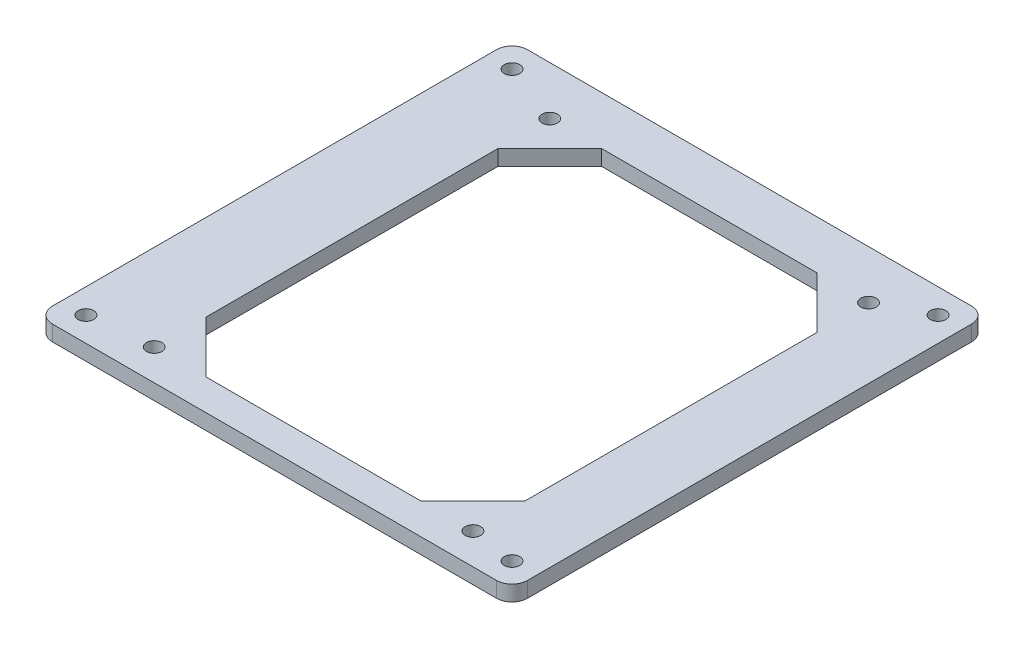
ISO-10303-21;
HEADER;
FILE_DESCRIPTION(('STEP AP214'),'2;1');
FILE_NAME('part.step','',(''),(''),'','','');
FILE_SCHEMA(('AUTOMOTIVE_DESIGN { 1 0 10303 214 1 1 1 1 }'));
ENDSEC;
DATA;
#1=APPLICATION_CONTEXT('core data for automotive mechanical design processes');
#2=APPLICATION_PROTOCOL_DEFINITION('international standard','automotive_design',2000,#1);
#3=PRODUCT_CONTEXT('',#1,'mechanical');
#4=PRODUCT('Part','Part','',(#3));
#5=PRODUCT_RELATED_PRODUCT_CATEGORY('part','',(#4));
#6=PRODUCT_DEFINITION_FORMATION('','',#4);
#7=PRODUCT_DEFINITION_CONTEXT('part definition',#1,'design');
#8=PRODUCT_DEFINITION('design','',#6,#7);
#9=PRODUCT_DEFINITION_SHAPE('','',#8);
#10=(LENGTH_UNIT() NAMED_UNIT(*) SI_UNIT(.MILLI.,.METRE.));
#11=(NAMED_UNIT(*) PLANE_ANGLE_UNIT() SI_UNIT($,.RADIAN.));
#12=(NAMED_UNIT(*) SI_UNIT($,.STERADIAN.) SOLID_ANGLE_UNIT());
#13=UNCERTAINTY_MEASURE_WITH_UNIT(LENGTH_MEASURE(1.E-05),#10,'distance_accuracy_value','');
#14=(GEOMETRIC_REPRESENTATION_CONTEXT(3) GLOBAL_UNCERTAINTY_ASSIGNED_CONTEXT((#13)) GLOBAL_UNIT_ASSIGNED_CONTEXT((#10,
#11,#12)) REPRESENTATION_CONTEXT('',''));
#15=CARTESIAN_POINT('',(0.,0.,0.));
#16=DIRECTION('',(0.,0.,1.));
#17=DIRECTION('',(1.,0.,0.));
#18=AXIS2_PLACEMENT_3D('',#15,#16,#17);
#19=CARTESIAN_POINT('',(-43.,0.,-43.));
#20=DIRECTION('',(0.,1.,0.));
#21=DIRECTION('',(0.,0.,1.));
#22=AXIS2_PLACEMENT_3D('',#19,#20,#21);
#23=CYLINDRICAL_SURFACE('',#22,3.);
#24=CARTESIAN_POINT('',(-43.,3.,-43.));
#25=DIRECTION('',(0.,1.,0.));
#26=DIRECTION('',(0.,0.,1.));
#27=AXIS2_PLACEMENT_3D('',#24,#25,#26);
#28=CIRCLE('',#27,3.);
#29=CARTESIAN_POINT('',(-43.,3.,-46.));
#30=VERTEX_POINT('',#29);
#31=CARTESIAN_POINT('',(-46.,3.,-43.));
#32=VERTEX_POINT('',#31);
#33=EDGE_CURVE('E211',#30,#32,#28,.T.);
#34=ORIENTED_EDGE('',*,*,#33,.F.);
#35=DIRECTION('',(0.,1.,0.));
#36=VECTOR('',#35,1.);
#37=CARTESIAN_POINT('',(-43.,0.,-46.));
#38=LINE('',#37,#36);
#39=CARTESIAN_POINT('',(-43.,0.,-46.));
#40=VERTEX_POINT('',#39);
#41=EDGE_CURVE('E11',#40,#30,#38,.T.);
#42=ORIENTED_EDGE('',*,*,#41,.F.);
#43=CARTESIAN_POINT('',(-43.,0.,-43.));
#44=DIRECTION('',(0.,1.,0.));
#45=DIRECTION('',(0.,0.,1.));
#46=AXIS2_PLACEMENT_3D('',#43,#44,#45);
#47=CIRCLE('',#46,3.);
#48=CARTESIAN_POINT('',(-46.,0.,-43.));
#49=VERTEX_POINT('',#48);
#50=EDGE_CURVE('E223',#40,#49,#47,.T.);
#51=ORIENTED_EDGE('',*,*,#50,.T.);
#52=DIRECTION('',(0.,1.,0.));
#53=VECTOR('',#52,1.);
#54=CARTESIAN_POINT('',(-46.,0.,-43.));
#55=LINE('',#54,#53);
#56=EDGE_CURVE('E40',#49,#32,#55,.T.);
#57=ORIENTED_EDGE('',*,*,#56,.T.);
#58=EDGE_LOOP('',(#34,#42,#51,#57));
#59=FACE_BOUND('',#58,.T.);
#60=ADVANCED_FACE('F37',(#59),#23,.T.);
#61=CARTESIAN_POINT('',(43.,0.,-46.));
#62=DIRECTION('',(0.,0.,-1.));
#63=DIRECTION('',(-1.,0.,0.));
#64=AXIS2_PLACEMENT_3D('',#61,#62,#63);
#65=PLANE('',#64);
#66=DIRECTION('',(-1.,0.,0.));
#67=VECTOR('',#66,1.);
#68=CARTESIAN_POINT('',(43.,3.,-46.));
#69=LINE('',#68,#67);
#70=CARTESIAN_POINT('',(43.,3.,-46.));
#71=VERTEX_POINT('',#70);
#72=EDGE_CURVE('E227',#71,#30,#69,.T.);
#73=ORIENTED_EDGE('',*,*,#72,.F.);
#74=DIRECTION('',(0.,1.,0.));
#75=VECTOR('',#74,1.);
#76=CARTESIAN_POINT('',(43.,0.,-46.));
#77=LINE('',#76,#75);
#78=CARTESIAN_POINT('',(43.,0.,-46.));
#79=VERTEX_POINT('',#78);
#80=EDGE_CURVE('E45',#79,#71,#77,.T.);
#81=ORIENTED_EDGE('',*,*,#80,.F.);
#82=DIRECTION('',(-1.,0.,0.));
#83=VECTOR('',#82,1.);
#84=CARTESIAN_POINT('',(43.,0.,-46.));
#85=LINE('',#84,#83);
#86=EDGE_CURVE('E245',#79,#40,#85,.T.);
#87=ORIENTED_EDGE('',*,*,#86,.T.);
#88=ORIENTED_EDGE('',*,*,#41,.T.);
#89=EDGE_LOOP('',(#73,#81,#87,#88));
#90=FACE_BOUND('',#89,.T.);
#91=ADVANCED_FACE('F292',(#90),#65,.T.);
#92=CARTESIAN_POINT('',(43.,0.,-43.));
#93=DIRECTION('',(0.,1.,0.));
#94=DIRECTION('',(0.,0.,1.));
#95=AXIS2_PLACEMENT_3D('',#92,#93,#94);
#96=CYLINDRICAL_SURFACE('',#95,3.);
#97=CARTESIAN_POINT('',(43.,3.,-43.));
#98=DIRECTION('',(0.,1.,0.));
#99=DIRECTION('',(0.,0.,1.));
#100=AXIS2_PLACEMENT_3D('',#97,#98,#99);
#101=CIRCLE('',#100,3.);
#102=CARTESIAN_POINT('',(46.,3.,-43.));
#103=VERTEX_POINT('',#102);
#104=EDGE_CURVE('E265',#103,#71,#101,.T.);
#105=ORIENTED_EDGE('',*,*,#104,.F.);
#106=DIRECTION('',(0.,1.,0.));
#107=VECTOR('',#106,1.);
#108=CARTESIAN_POINT('',(46.,0.,-43.));
#109=LINE('',#108,#107);
#110=CARTESIAN_POINT('',(46.,0.,-43.));
#111=VERTEX_POINT('',#110);
#112=EDGE_CURVE('E271',#111,#103,#109,.T.);
#113=ORIENTED_EDGE('',*,*,#112,.F.);
#114=CARTESIAN_POINT('',(43.,0.,-43.));
#115=DIRECTION('',(0.,1.,0.));
#116=DIRECTION('',(0.,0.,1.));
#117=AXIS2_PLACEMENT_3D('',#114,#115,#116);
#118=CIRCLE('',#117,3.);
#119=EDGE_CURVE('E242',#111,#79,#118,.T.);
#120=ORIENTED_EDGE('',*,*,#119,.T.);
#121=ORIENTED_EDGE('',*,*,#80,.T.);
#122=EDGE_LOOP('',(#105,#113,#120,#121));
#123=FACE_BOUND('',#122,.T.);
#124=ADVANCED_FACE('F311',(#123),#96,.T.);
#125=CARTESIAN_POINT('',(46.,0.,43.));
#126=DIRECTION('',(1.,0.,0.));
#127=DIRECTION('',(0.,0.,-1.));
#128=AXIS2_PLACEMENT_3D('',#125,#126,#127);
#129=PLANE('',#128);
#130=DIRECTION('',(0.,0.,-1.));
#131=VECTOR('',#130,1.);
#132=CARTESIAN_POINT('',(46.,3.,43.));
#133=LINE('',#132,#131);
#134=CARTESIAN_POINT('',(46.,3.,43.));
#135=VERTEX_POINT('',#134);
#136=EDGE_CURVE('E262',#135,#103,#133,.T.);
#137=ORIENTED_EDGE('',*,*,#136,.F.);
#138=DIRECTION('',(0.,1.,0.));
#139=VECTOR('',#138,1.);
#140=CARTESIAN_POINT('',(46.,0.,43.));
#141=LINE('',#140,#139);
#142=CARTESIAN_POINT('',(46.,0.,43.));
#143=VERTEX_POINT('',#142);
#144=EDGE_CURVE('E273',#143,#135,#141,.T.);
#145=ORIENTED_EDGE('',*,*,#144,.F.);
#146=DIRECTION('',(0.,0.,-1.));
#147=VECTOR('',#146,1.);
#148=CARTESIAN_POINT('',(46.,0.,43.));
#149=LINE('',#148,#147);
#150=EDGE_CURVE('E239',#143,#111,#149,.T.);
#151=ORIENTED_EDGE('',*,*,#150,.T.);
#152=ORIENTED_EDGE('',*,*,#112,.T.);
#153=EDGE_LOOP('',(#137,#145,#151,#152));
#154=FACE_BOUND('',#153,.T.);
#155=ADVANCED_FACE('F309',(#154),#129,.T.);
#156=CARTESIAN_POINT('',(43.,0.,43.));
#157=DIRECTION('',(0.,1.,0.));
#158=DIRECTION('',(0.,0.,1.));
#159=AXIS2_PLACEMENT_3D('',#156,#157,#158);
#160=CYLINDRICAL_SURFACE('',#159,3.);
#161=CARTESIAN_POINT('',(43.,3.,43.));
#162=DIRECTION('',(0.,1.,0.));
#163=DIRECTION('',(0.,0.,1.));
#164=AXIS2_PLACEMENT_3D('',#161,#162,#163);
#165=CIRCLE('',#164,3.);
#166=CARTESIAN_POINT('',(43.,3.,46.));
#167=VERTEX_POINT('',#166);
#168=EDGE_CURVE('E259',#167,#135,#165,.T.);
#169=ORIENTED_EDGE('',*,*,#168,.F.);
#170=DIRECTION('',(0.,1.,0.));
#171=VECTOR('',#170,1.);
#172=CARTESIAN_POINT('',(43.,0.,46.));
#173=LINE('',#172,#171);
#174=CARTESIAN_POINT('',(43.,0.,46.));
#175=VERTEX_POINT('',#174);
#176=EDGE_CURVE('E275',#175,#167,#173,.T.);
#177=ORIENTED_EDGE('',*,*,#176,.F.);
#178=CARTESIAN_POINT('',(43.,0.,43.));
#179=DIRECTION('',(0.,1.,0.));
#180=DIRECTION('',(0.,0.,1.));
#181=AXIS2_PLACEMENT_3D('',#178,#179,#180);
#182=CIRCLE('',#181,3.);
#183=EDGE_CURVE('E236',#175,#143,#182,.T.);
#184=ORIENTED_EDGE('',*,*,#183,.T.);
#185=ORIENTED_EDGE('',*,*,#144,.T.);
#186=EDGE_LOOP('',(#169,#177,#184,#185));
#187=FACE_BOUND('',#186,.T.);
#188=ADVANCED_FACE('F305',(#187),#160,.T.);
#189=CARTESIAN_POINT('',(-43.,0.,46.));
#190=DIRECTION('',(0.,0.,1.));
#191=DIRECTION('',(1.,0.,0.));
#192=AXIS2_PLACEMENT_3D('',#189,#190,#191);
#193=PLANE('',#192);
#194=DIRECTION('',(1.,0.,0.));
#195=VECTOR('',#194,1.);
#196=CARTESIAN_POINT('',(-43.,3.,46.));
#197=LINE('',#196,#195);
#198=CARTESIAN_POINT('',(-43.,3.,46.));
#199=VERTEX_POINT('',#198);
#200=EDGE_CURVE('E256',#199,#167,#197,.T.);
#201=ORIENTED_EDGE('',*,*,#200,.F.);
#202=DIRECTION('',(0.,1.,0.));
#203=VECTOR('',#202,1.);
#204=CARTESIAN_POINT('',(-43.,0.,46.));
#205=LINE('',#204,#203);
#206=CARTESIAN_POINT('',(-43.,0.,46.));
#207=VERTEX_POINT('',#206);
#208=EDGE_CURVE('E277',#207,#199,#205,.T.);
#209=ORIENTED_EDGE('',*,*,#208,.F.);
#210=DIRECTION('',(1.,0.,0.));
#211=VECTOR('',#210,1.);
#212=CARTESIAN_POINT('',(-43.,0.,46.));
#213=LINE('',#212,#211);
#214=EDGE_CURVE('E233',#207,#175,#213,.T.);
#215=ORIENTED_EDGE('',*,*,#214,.T.);
#216=ORIENTED_EDGE('',*,*,#176,.T.);
#217=EDGE_LOOP('',(#201,#209,#215,#216));
#218=FACE_BOUND('',#217,.T.);
#219=ADVANCED_FACE('F303',(#218),#193,.T.);
#220=CARTESIAN_POINT('',(-43.,0.,43.));
#221=DIRECTION('',(0.,1.,0.));
#222=DIRECTION('',(0.,0.,1.));
#223=AXIS2_PLACEMENT_3D('',#220,#221,#222);
#224=CYLINDRICAL_SURFACE('',#223,3.);
#225=CARTESIAN_POINT('',(-43.,3.,43.));
#226=DIRECTION('',(0.,1.,0.));
#227=DIRECTION('',(0.,0.,1.));
#228=AXIS2_PLACEMENT_3D('',#225,#226,#227);
#229=CIRCLE('',#228,3.);
#230=CARTESIAN_POINT('',(-46.,3.,43.));
#231=VERTEX_POINT('',#230);
#232=EDGE_CURVE('E253',#231,#199,#229,.T.);
#233=ORIENTED_EDGE('',*,*,#232,.F.);
#234=DIRECTION('',(0.,1.,0.));
#235=VECTOR('',#234,1.);
#236=CARTESIAN_POINT('',(-46.,0.,43.));
#237=LINE('',#236,#235);
#238=CARTESIAN_POINT('',(-46.,0.,43.));
#239=VERTEX_POINT('',#238);
#240=EDGE_CURVE('E278',#239,#231,#237,.T.);
#241=ORIENTED_EDGE('',*,*,#240,.F.);
#242=CARTESIAN_POINT('',(-43.,0.,43.));
#243=DIRECTION('',(0.,1.,0.));
#244=DIRECTION('',(0.,0.,1.));
#245=AXIS2_PLACEMENT_3D('',#242,#243,#244);
#246=CIRCLE('',#245,3.);
#247=EDGE_CURVE('E230',#239,#207,#246,.T.);
#248=ORIENTED_EDGE('',*,*,#247,.T.);
#249=ORIENTED_EDGE('',*,*,#208,.T.);
#250=EDGE_LOOP('',(#233,#241,#248,#249));
#251=FACE_BOUND('',#250,.T.);
#252=ADVANCED_FACE('F299',(#251),#224,.T.);
#253=CARTESIAN_POINT('',(-46.,0.,-43.));
#254=DIRECTION('',(-1.,0.,0.));
#255=DIRECTION('',(0.,0.,1.));
#256=AXIS2_PLACEMENT_3D('',#253,#254,#255);
#257=PLANE('',#256);
#258=DIRECTION('',(0.,0.,1.));
#259=VECTOR('',#258,1.);
#260=CARTESIAN_POINT('',(-46.,3.,-43.));
#261=LINE('',#260,#259);
#262=EDGE_CURVE('E250',#32,#231,#261,.T.);
#263=ORIENTED_EDGE('',*,*,#262,.F.);
#264=ORIENTED_EDGE('',*,*,#56,.F.);
#265=DIRECTION('',(0.,0.,1.));
#266=VECTOR('',#265,1.);
#267=CARTESIAN_POINT('',(-46.,0.,-43.));
#268=LINE('',#267,#266);
#269=EDGE_CURVE('E226',#49,#239,#268,.T.);
#270=ORIENTED_EDGE('',*,*,#269,.T.);
#271=ORIENTED_EDGE('',*,*,#240,.T.);
#272=EDGE_LOOP('',(#263,#264,#270,#271));
#273=FACE_BOUND('',#272,.T.);
#274=ADVANCED_FACE('F286',(#273),#257,.T.);
#275=CARTESIAN_POINT('',(-43.,0.,-43.));
#276=DIRECTION('',(0.,1.,0.));
#277=DIRECTION('',(0.,0.,1.));
#278=AXIS2_PLACEMENT_3D('',#275,#276,#277);
#279=PLANE('',#278);
#280=CARTESIAN_POINT('',(-41.2499999999991,0.,41.25));
#281=DIRECTION('',(0.,1.,0.));
#282=DIRECTION('',(0.,0.,-1.));
#283=AXIS2_PLACEMENT_3D('',#280,#281,#282);
#284=CIRCLE('',#283,1.5);
#285=CARTESIAN_POINT('',(-41.2499999999991,0.,39.75));
#286=VERTEX_POINT('',#285);
#287=EDGE_CURVE('E548',#286,#286,#284,.T.);
#288=ORIENTED_EDGE('',*,*,#287,.T.);
#289=EDGE_LOOP('',(#288));
#290=FACE_BOUND('',#289,.T.);
#291=CARTESIAN_POINT('',(41.25,0.,-41.25));
#292=DIRECTION('',(0.,1.,0.));
#293=DIRECTION('',(0.,0.,-1.));
#294=AXIS2_PLACEMENT_3D('',#291,#292,#293);
#295=CIRCLE('',#294,1.5);
#296=CARTESIAN_POINT('',(41.25,0.,-42.75));
#297=VERTEX_POINT('',#296);
#298=EDGE_CURVE('E556',#297,#297,#295,.T.);
#299=ORIENTED_EDGE('',*,*,#298,.T.);
#300=EDGE_LOOP('',(#299));
#301=FACE_BOUND('',#300,.T.);
#302=CARTESIAN_POINT('',(-41.25,0.,-41.25));
#303=DIRECTION('',(0.,1.,0.));
#304=DIRECTION('',(0.,0.,-1.));
#305=AXIS2_PLACEMENT_3D('',#302,#303,#304);
#306=CIRCLE('',#305,1.5);
#307=CARTESIAN_POINT('',(-41.25,0.,-42.75));
#308=VERTEX_POINT('',#307);
#309=EDGE_CURVE('E562',#308,#308,#306,.T.);
#310=ORIENTED_EDGE('',*,*,#309,.T.);
#311=EDGE_LOOP('',(#310));
#312=FACE_BOUND('',#311,.T.);
#313=CARTESIAN_POINT('',(41.2500000000008,0.,41.25));
#314=DIRECTION('',(0.,1.,0.));
#315=DIRECTION('',(0.,0.,-1.));
#316=AXIS2_PLACEMENT_3D('',#313,#314,#315);
#317=CIRCLE('',#316,1.5);
#318=CARTESIAN_POINT('',(41.2500000000008,0.,39.75));
#319=VERTEX_POINT('',#318);
#320=EDGE_CURVE('E568',#319,#319,#317,.T.);
#321=ORIENTED_EDGE('',*,*,#320,.T.);
#322=EDGE_LOOP('',(#321));
#323=FACE_BOUND('',#322,.T.);
#324=CARTESIAN_POINT('',(-29.2849999999992,0.,40.));
#325=DIRECTION('',(0.,1.,0.));
#326=DIRECTION('',(0.,0.,-1.));
#327=AXIS2_PLACEMENT_3D('',#324,#325,#326);
#328=CIRCLE('',#327,1.5);
#329=CARTESIAN_POINT('',(-29.2849999999992,0.,38.5));
#330=VERTEX_POINT('',#329);
#331=EDGE_CURVE('E574',#330,#330,#328,.T.);
#332=ORIENTED_EDGE('',*,*,#331,.T.);
#333=EDGE_LOOP('',(#332));
#334=FACE_BOUND('',#333,.T.);
#335=CARTESIAN_POINT('',(32.4350000000008,0.,40.));
#336=DIRECTION('',(0.,1.,0.));
#337=DIRECTION('',(0.,0.,-1.));
#338=AXIS2_PLACEMENT_3D('',#335,#336,#337);
#339=CIRCLE('',#338,1.5);
#340=CARTESIAN_POINT('',(32.4350000000008,0.,38.5));
#341=VERTEX_POINT('',#340);
#342=EDGE_CURVE('E580',#341,#341,#339,.T.);
#343=ORIENTED_EDGE('',*,*,#342,.T.);
#344=EDGE_LOOP('',(#343));
#345=FACE_BOUND('',#344,.T.);
#346=CARTESIAN_POINT('',(32.435,0.,-36.6));
#347=DIRECTION('',(0.,1.,0.));
#348=DIRECTION('',(0.,0.,-1.));
#349=AXIS2_PLACEMENT_3D('',#346,#347,#348);
#350=CIRCLE('',#349,1.5);
#351=CARTESIAN_POINT('',(32.435,0.,-38.1));
#352=VERTEX_POINT('',#351);
#353=EDGE_CURVE('E586',#352,#352,#350,.T.);
#354=ORIENTED_EDGE('',*,*,#353,.T.);
#355=EDGE_LOOP('',(#354));
#356=FACE_BOUND('',#355,.T.);
#357=CARTESIAN_POINT('',(-29.285,0.,-36.6));
#358=DIRECTION('',(0.,1.,0.));
#359=DIRECTION('',(0.,0.,-1.));
#360=AXIS2_PLACEMENT_3D('',#357,#358,#359);
#361=CIRCLE('',#360,1.5);
#362=CARTESIAN_POINT('',(-29.285,0.,-38.1));
#363=VERTEX_POINT('',#362);
#364=EDGE_CURVE('E193',#363,#363,#361,.T.);
#365=ORIENTED_EDGE('',*,*,#364,.T.);
#366=EDGE_LOOP('',(#365));
#367=FACE_BOUND('',#366,.T.);
#368=DIRECTION('',(-1.,0.,0.));
#369=VECTOR('',#368,1.);
#370=CARTESIAN_POINT('',(-19.285,0.,-36.6));
#371=LINE('',#370,#369);
#372=CARTESIAN_POINT('',(22.4350000000008,0.,-36.6));
#373=VERTEX_POINT('',#372);
#374=CARTESIAN_POINT('',(-19.285,0.,-36.6));
#375=VERTEX_POINT('',#374);
#376=EDGE_CURVE('E158',#373,#375,#371,.T.);
#377=ORIENTED_EDGE('',*,*,#376,.T.);
#378=DIRECTION('',(-0.707106781186547,0.,0.707106781186548));
#379=VECTOR('',#378,1.);
#380=CARTESIAN_POINT('',(-29.285,0.,-26.6));
#381=LINE('',#380,#379);
#382=CARTESIAN_POINT('',(-29.285,0.,-26.6));
#383=VERTEX_POINT('',#382);
#384=EDGE_CURVE('E152',#375,#383,#381,.T.);
#385=ORIENTED_EDGE('',*,*,#384,.T.);
#386=DIRECTION('',(0.,0.,1.));
#387=VECTOR('',#386,1.);
#388=CARTESIAN_POINT('',(-29.285,0.,30.));
#389=LINE('',#388,#387);
#390=CARTESIAN_POINT('',(-29.285,0.,30.));
#391=VERTEX_POINT('',#390);
#392=EDGE_CURVE('E161',#383,#391,#389,.T.);
#393=ORIENTED_EDGE('',*,*,#392,.T.);
#394=DIRECTION('',(0.707106781186547,0.,0.707106781186548));
#395=VECTOR('',#394,1.);
#396=CARTESIAN_POINT('',(-19.285,0.,40.));
#397=LINE('',#396,#395);
#398=CARTESIAN_POINT('',(-19.285,0.,40.));
#399=VERTEX_POINT('',#398);
#400=EDGE_CURVE('E53',#391,#399,#397,.T.);
#401=ORIENTED_EDGE('',*,*,#400,.T.);
#402=DIRECTION('',(1.,0.,0.));
#403=VECTOR('',#402,1.);
#404=CARTESIAN_POINT('',(22.4350000000008,0.,40.));
#405=LINE('',#404,#403);
#406=CARTESIAN_POINT('',(22.4350000000008,0.,40.));
#407=VERTEX_POINT('',#406);
#408=EDGE_CURVE('E179',#399,#407,#405,.T.);
#409=ORIENTED_EDGE('',*,*,#408,.T.);
#410=DIRECTION('',(0.707106781186547,0.,-0.707106781186548));
#411=VECTOR('',#410,1.);
#412=CARTESIAN_POINT('',(32.4350000000008,0.,30.));
#413=LINE('',#412,#411);
#414=CARTESIAN_POINT('',(32.4350000000008,0.,30.));
#415=VERTEX_POINT('',#414);
#416=EDGE_CURVE('E182',#407,#415,#413,.T.);
#417=ORIENTED_EDGE('',*,*,#416,.T.);
#418=DIRECTION('',(0.,0.,-1.));
#419=VECTOR('',#418,1.);
#420=CARTESIAN_POINT('',(32.4350000000008,0.,-26.6));
#421=LINE('',#420,#419);
#422=CARTESIAN_POINT('',(32.4350000000008,0.,-26.6));
#423=VERTEX_POINT('',#422);
#424=EDGE_CURVE('E185',#415,#423,#421,.T.);
#425=ORIENTED_EDGE('',*,*,#424,.T.);
#426=DIRECTION('',(-0.707106781186547,0.,-0.707106781186548));
#427=VECTOR('',#426,1.);
#428=CARTESIAN_POINT('',(22.4350000000008,0.,-36.6));
#429=LINE('',#428,#427);
#430=EDGE_CURVE('E188',#423,#373,#429,.T.);
#431=ORIENTED_EDGE('',*,*,#430,.T.);
#432=EDGE_LOOP('',(#377,#385,#393,#401,#409,#417,#425,#431));
#433=FACE_BOUND('',#432,.T.);
#434=ORIENTED_EDGE('',*,*,#50,.F.);
#435=ORIENTED_EDGE('',*,*,#86,.F.);
#436=ORIENTED_EDGE('',*,*,#119,.F.);
#437=ORIENTED_EDGE('',*,*,#150,.F.);
#438=ORIENTED_EDGE('',*,*,#183,.F.);
#439=ORIENTED_EDGE('',*,*,#214,.F.);
#440=ORIENTED_EDGE('',*,*,#247,.F.);
#441=ORIENTED_EDGE('',*,*,#269,.F.);
#442=EDGE_LOOP('',(#434,#435,#436,#437,#438,#439,#440,#441));
#443=FACE_BOUND('',#442,.T.);
#444=ADVANCED_FACE('F165',(#290,#301,#312,#323,#334,#345,#356,#367,#433,#443),#279,.F.);
#445=CARTESIAN_POINT('',(-43.,3.,-43.));
#446=DIRECTION('',(0.,1.,0.));
#447=DIRECTION('',(0.,0.,1.));
#448=AXIS2_PLACEMENT_3D('',#445,#446,#447);
#449=PLANE('',#448);
#450=CARTESIAN_POINT('',(-41.2499999999991,3.,41.25));
#451=DIRECTION('',(0.,1.,0.));
#452=DIRECTION('',(0.,0.,-1.));
#453=AXIS2_PLACEMENT_3D('',#450,#451,#452);
#454=CIRCLE('',#453,1.5);
#455=CARTESIAN_POINT('',(-41.2499999999991,3.,39.75));
#456=VERTEX_POINT('',#455);
#457=EDGE_CURVE('E551',#456,#456,#454,.T.);
#458=ORIENTED_EDGE('',*,*,#457,.F.);
#459=EDGE_LOOP('',(#458));
#460=FACE_BOUND('',#459,.T.);
#461=CARTESIAN_POINT('',(41.25,3.,-41.25));
#462=DIRECTION('',(0.,1.,0.));
#463=DIRECTION('',(0.,0.,-1.));
#464=AXIS2_PLACEMENT_3D('',#461,#462,#463);
#465=CIRCLE('',#464,1.5);
#466=CARTESIAN_POINT('',(41.25,3.,-42.75));
#467=VERTEX_POINT('',#466);
#468=EDGE_CURVE('E553',#467,#467,#465,.T.);
#469=ORIENTED_EDGE('',*,*,#468,.F.);
#470=EDGE_LOOP('',(#469));
#471=FACE_BOUND('',#470,.T.);
#472=CARTESIAN_POINT('',(-41.25,3.,-41.25));
#473=DIRECTION('',(0.,1.,0.));
#474=DIRECTION('',(0.,0.,-1.));
#475=AXIS2_PLACEMENT_3D('',#472,#473,#474);
#476=CIRCLE('',#475,1.5);
#477=CARTESIAN_POINT('',(-41.25,3.,-42.75));
#478=VERTEX_POINT('',#477);
#479=EDGE_CURVE('E559',#478,#478,#476,.T.);
#480=ORIENTED_EDGE('',*,*,#479,.F.);
#481=EDGE_LOOP('',(#480));
#482=FACE_BOUND('',#481,.T.);
#483=CARTESIAN_POINT('',(41.2500000000008,3.,41.25));
#484=DIRECTION('',(0.,1.,0.));
#485=DIRECTION('',(0.,0.,-1.));
#486=AXIS2_PLACEMENT_3D('',#483,#484,#485);
#487=CIRCLE('',#486,1.5);
#488=CARTESIAN_POINT('',(41.2500000000008,3.,39.75));
#489=VERTEX_POINT('',#488);
#490=EDGE_CURVE('E565',#489,#489,#487,.T.);
#491=ORIENTED_EDGE('',*,*,#490,.F.);
#492=EDGE_LOOP('',(#491));
#493=FACE_BOUND('',#492,.T.);
#494=CARTESIAN_POINT('',(-29.2849999999992,3.,40.));
#495=DIRECTION('',(0.,1.,0.));
#496=DIRECTION('',(0.,0.,-1.));
#497=AXIS2_PLACEMENT_3D('',#494,#495,#496);
#498=CIRCLE('',#497,1.5);
#499=CARTESIAN_POINT('',(-29.2849999999992,3.,38.5));
#500=VERTEX_POINT('',#499);
#501=EDGE_CURVE('E571',#500,#500,#498,.T.);
#502=ORIENTED_EDGE('',*,*,#501,.F.);
#503=EDGE_LOOP('',(#502));
#504=FACE_BOUND('',#503,.T.);
#505=CARTESIAN_POINT('',(32.4350000000008,3.,40.));
#506=DIRECTION('',(0.,1.,0.));
#507=DIRECTION('',(0.,0.,-1.));
#508=AXIS2_PLACEMENT_3D('',#505,#506,#507);
#509=CIRCLE('',#508,1.5);
#510=CARTESIAN_POINT('',(32.4350000000008,3.,38.5));
#511=VERTEX_POINT('',#510);
#512=EDGE_CURVE('E577',#511,#511,#509,.T.);
#513=ORIENTED_EDGE('',*,*,#512,.F.);
#514=EDGE_LOOP('',(#513));
#515=FACE_BOUND('',#514,.T.);
#516=CARTESIAN_POINT('',(32.435,3.,-36.6));
#517=DIRECTION('',(0.,1.,0.));
#518=DIRECTION('',(0.,0.,-1.));
#519=AXIS2_PLACEMENT_3D('',#516,#517,#518);
#520=CIRCLE('',#519,1.5);
#521=CARTESIAN_POINT('',(32.435,3.,-38.1));
#522=VERTEX_POINT('',#521);
#523=EDGE_CURVE('E583',#522,#522,#520,.T.);
#524=ORIENTED_EDGE('',*,*,#523,.F.);
#525=EDGE_LOOP('',(#524));
#526=FACE_BOUND('',#525,.T.);
#527=CARTESIAN_POINT('',(-29.285,3.,-36.6));
#528=DIRECTION('',(0.,1.,0.));
#529=DIRECTION('',(0.,0.,-1.));
#530=AXIS2_PLACEMENT_3D('',#527,#528,#529);
#531=CIRCLE('',#530,1.5);
#532=CARTESIAN_POINT('',(-29.285,3.,-38.1));
#533=VERTEX_POINT('',#532);
#534=EDGE_CURVE('E175',#533,#533,#531,.T.);
#535=ORIENTED_EDGE('',*,*,#534,.F.);
#536=EDGE_LOOP('',(#535));
#537=FACE_BOUND('',#536,.T.);
#538=DIRECTION('',(-0.707106781186547,0.,0.707106781186548));
#539=VECTOR('',#538,1.);
#540=CARTESIAN_POINT('',(-29.285,3.,-26.6));
#541=LINE('',#540,#539);
#542=CARTESIAN_POINT('',(-19.285,3.,-36.6));
#543=VERTEX_POINT('',#542);
#544=CARTESIAN_POINT('',(-29.285,3.,-26.6));
#545=VERTEX_POINT('',#544);
#546=EDGE_CURVE('E61',#543,#545,#541,.T.);
#547=ORIENTED_EDGE('',*,*,#546,.F.);
#548=DIRECTION('',(-1.,0.,0.));
#549=VECTOR('',#548,1.);
#550=CARTESIAN_POINT('',(-19.285,3.,-36.6));
#551=LINE('',#550,#549);
#552=CARTESIAN_POINT('',(22.4350000000008,3.,-36.6));
#553=VERTEX_POINT('',#552);
#554=EDGE_CURVE('E169',#553,#543,#551,.T.);
#555=ORIENTED_EDGE('',*,*,#554,.F.);
#556=DIRECTION('',(-0.707106781186547,0.,-0.707106781186548));
#557=VECTOR('',#556,1.);
#558=CARTESIAN_POINT('',(22.4350000000008,3.,-36.6));
#559=LINE('',#558,#557);
#560=CARTESIAN_POINT('',(32.4350000000008,3.,-26.6));
#561=VERTEX_POINT('',#560);
#562=EDGE_CURVE('E172',#561,#553,#559,.T.);
#563=ORIENTED_EDGE('',*,*,#562,.F.);
#564=DIRECTION('',(0.,0.,-1.));
#565=VECTOR('',#564,1.);
#566=CARTESIAN_POINT('',(32.4350000000008,3.,-26.6));
#567=LINE('',#566,#565);
#568=CARTESIAN_POINT('',(32.4350000000008,3.,30.));
#569=VERTEX_POINT('',#568);
#570=EDGE_CURVE('E204',#569,#561,#567,.T.);
#571=ORIENTED_EDGE('',*,*,#570,.F.);
#572=DIRECTION('',(0.707106781186547,0.,-0.707106781186548));
#573=VECTOR('',#572,1.);
#574=CARTESIAN_POINT('',(32.4350000000008,3.,30.));
#575=LINE('',#574,#573);
#576=CARTESIAN_POINT('',(22.4350000000008,3.,40.));
#577=VERTEX_POINT('',#576);
#578=EDGE_CURVE('E201',#577,#569,#575,.T.);
#579=ORIENTED_EDGE('',*,*,#578,.F.);
#580=DIRECTION('',(1.,0.,0.));
#581=VECTOR('',#580,1.);
#582=CARTESIAN_POINT('',(22.4350000000008,3.,40.));
#583=LINE('',#582,#581);
#584=CARTESIAN_POINT('',(-19.285,3.,40.));
#585=VERTEX_POINT('',#584);
#586=EDGE_CURVE('E198',#585,#577,#583,.T.);
#587=ORIENTED_EDGE('',*,*,#586,.F.);
#588=DIRECTION('',(0.707106781186547,0.,0.707106781186548));
#589=VECTOR('',#588,1.);
#590=CARTESIAN_POINT('',(-19.285,3.,40.));
#591=LINE('',#590,#589);
#592=CARTESIAN_POINT('',(-29.285,3.,30.));
#593=VERTEX_POINT('',#592);
#594=EDGE_CURVE('E195',#593,#585,#591,.T.);
#595=ORIENTED_EDGE('',*,*,#594,.F.);
#596=DIRECTION('',(0.,0.,1.));
#597=VECTOR('',#596,1.);
#598=CARTESIAN_POINT('',(-29.285,3.,30.));
#599=LINE('',#598,#597);
#600=EDGE_CURVE('E192',#545,#593,#599,.T.);
#601=ORIENTED_EDGE('',*,*,#600,.F.);
#602=EDGE_LOOP('',(#547,#555,#563,#571,#579,#587,#595,#601));
#603=FACE_BOUND('',#602,.T.);
#604=ORIENTED_EDGE('',*,*,#33,.T.);
#605=ORIENTED_EDGE('',*,*,#262,.T.);
#606=ORIENTED_EDGE('',*,*,#232,.T.);
#607=ORIENTED_EDGE('',*,*,#200,.T.);
#608=ORIENTED_EDGE('',*,*,#168,.T.);
#609=ORIENTED_EDGE('',*,*,#136,.T.);
#610=ORIENTED_EDGE('',*,*,#104,.T.);
#611=ORIENTED_EDGE('',*,*,#72,.T.);
#612=EDGE_LOOP('',(#604,#605,#606,#607,#608,#609,#610,#611));
#613=FACE_BOUND('',#612,.T.);
#614=ADVANCED_FACE('F288',(#460,#471,#482,#493,#504,#515,#526,#537,#603,#613),#449,.T.);
#615=CARTESIAN_POINT('',(-29.285,0.,-26.6));
#616=DIRECTION('',(-0.707106781186548,0.,-0.707106781186547));
#617=DIRECTION('',(-0.707106781186547,0.,0.707106781186548));
#618=AXIS2_PLACEMENT_3D('',#615,#616,#617);
#619=PLANE('',#618);
#620=ORIENTED_EDGE('',*,*,#546,.T.);
#621=DIRECTION('',(0.,1.,0.));
#622=VECTOR('',#621,1.);
#623=CARTESIAN_POINT('',(-29.285,0.,-26.6));
#624=LINE('',#623,#622);
#625=EDGE_CURVE('E148',#383,#545,#624,.T.);
#626=ORIENTED_EDGE('',*,*,#625,.F.);
#627=ORIENTED_EDGE('',*,*,#384,.F.);
#628=DIRECTION('',(0.,1.,0.));
#629=VECTOR('',#628,1.);
#630=CARTESIAN_POINT('',(-19.285,0.,-36.6));
#631=LINE('',#630,#629);
#632=EDGE_CURVE('E209',#375,#543,#631,.T.);
#633=ORIENTED_EDGE('',*,*,#632,.T.);
#634=EDGE_LOOP('',(#620,#626,#627,#633));
#635=FACE_BOUND('',#634,.T.);
#636=ADVANCED_FACE('F150',(#635),#619,.F.);
#637=CARTESIAN_POINT('',(-19.285,0.,-36.6));
#638=DIRECTION('',(0.,0.,-1.));
#639=DIRECTION('',(-1.,0.,0.));
#640=AXIS2_PLACEMENT_3D('',#637,#638,#639);
#641=PLANE('',#640);
#642=ORIENTED_EDGE('',*,*,#554,.T.);
#643=ORIENTED_EDGE('',*,*,#632,.F.);
#644=ORIENTED_EDGE('',*,*,#376,.F.);
#645=DIRECTION('',(0.,1.,0.));
#646=VECTOR('',#645,1.);
#647=CARTESIAN_POINT('',(22.4350000000008,0.,-36.6));
#648=LINE('',#647,#646);
#649=EDGE_CURVE('E212',#373,#553,#648,.T.);
#650=ORIENTED_EDGE('',*,*,#649,.T.);
#651=EDGE_LOOP('',(#642,#643,#644,#650));
#652=FACE_BOUND('',#651,.T.);
#653=ADVANCED_FACE('F395',(#652),#641,.F.);
#654=CARTESIAN_POINT('',(22.4350000000008,0.,-36.6));
#655=DIRECTION('',(0.707106781186548,0.,-0.707106781186547));
#656=DIRECTION('',(-0.707106781186547,0.,-0.707106781186548));
#657=AXIS2_PLACEMENT_3D('',#654,#655,#656);
#658=PLANE('',#657);
#659=ORIENTED_EDGE('',*,*,#562,.T.);
#660=ORIENTED_EDGE('',*,*,#649,.F.);
#661=ORIENTED_EDGE('',*,*,#430,.F.);
#662=DIRECTION('',(0.,1.,0.));
#663=VECTOR('',#662,1.);
#664=CARTESIAN_POINT('',(32.4350000000008,0.,-26.6));
#665=LINE('',#664,#663);
#666=EDGE_CURVE('E214',#423,#561,#665,.T.);
#667=ORIENTED_EDGE('',*,*,#666,.T.);
#668=EDGE_LOOP('',(#659,#660,#661,#667));
#669=FACE_BOUND('',#668,.T.);
#670=ADVANCED_FACE('F404',(#669),#658,.F.);
#671=CARTESIAN_POINT('',(32.4350000000008,0.,-26.6));
#672=DIRECTION('',(1.,0.,0.));
#673=DIRECTION('',(0.,0.,-1.));
#674=AXIS2_PLACEMENT_3D('',#671,#672,#673);
#675=PLANE('',#674);
#676=ORIENTED_EDGE('',*,*,#570,.T.);
#677=ORIENTED_EDGE('',*,*,#666,.F.);
#678=ORIENTED_EDGE('',*,*,#424,.F.);
#679=DIRECTION('',(0.,1.,0.));
#680=VECTOR('',#679,1.);
#681=CARTESIAN_POINT('',(32.4350000000008,0.,30.));
#682=LINE('',#681,#680);
#683=EDGE_CURVE('E216',#415,#569,#682,.T.);
#684=ORIENTED_EDGE('',*,*,#683,.T.);
#685=EDGE_LOOP('',(#676,#677,#678,#684));
#686=FACE_BOUND('',#685,.T.);
#687=ADVANCED_FACE('F414',(#686),#675,.F.);
#688=CARTESIAN_POINT('',(32.4350000000008,0.,30.));
#689=DIRECTION('',(0.707106781186548,0.,0.707106781186547));
#690=DIRECTION('',(0.707106781186547,0.,-0.707106781186548));
#691=AXIS2_PLACEMENT_3D('',#688,#689,#690);
#692=PLANE('',#691);
#693=ORIENTED_EDGE('',*,*,#578,.T.);
#694=ORIENTED_EDGE('',*,*,#683,.F.);
#695=ORIENTED_EDGE('',*,*,#416,.F.);
#696=DIRECTION('',(0.,1.,0.));
#697=VECTOR('',#696,1.);
#698=CARTESIAN_POINT('',(22.4350000000008,0.,40.));
#699=LINE('',#698,#697);
#700=EDGE_CURVE('E218',#407,#577,#699,.T.);
#701=ORIENTED_EDGE('',*,*,#700,.T.);
#702=EDGE_LOOP('',(#693,#694,#695,#701));
#703=FACE_BOUND('',#702,.T.);
#704=ADVANCED_FACE('F424',(#703),#692,.F.);
#705=CARTESIAN_POINT('',(22.4350000000008,0.,40.));
#706=DIRECTION('',(0.,0.,1.));
#707=DIRECTION('',(1.,0.,0.));
#708=AXIS2_PLACEMENT_3D('',#705,#706,#707);
#709=PLANE('',#708);
#710=ORIENTED_EDGE('',*,*,#586,.T.);
#711=ORIENTED_EDGE('',*,*,#700,.F.);
#712=ORIENTED_EDGE('',*,*,#408,.F.);
#713=DIRECTION('',(0.,1.,0.));
#714=VECTOR('',#713,1.);
#715=CARTESIAN_POINT('',(-19.285,0.,40.));
#716=LINE('',#715,#714);
#717=EDGE_CURVE('E220',#399,#585,#716,.T.);
#718=ORIENTED_EDGE('',*,*,#717,.T.);
#719=EDGE_LOOP('',(#710,#711,#712,#718));
#720=FACE_BOUND('',#719,.T.);
#721=ADVANCED_FACE('F434',(#720),#709,.F.);
#722=CARTESIAN_POINT('',(-19.285,0.,40.));
#723=DIRECTION('',(-0.707106781186548,0.,0.707106781186547));
#724=DIRECTION('',(0.707106781186547,0.,0.707106781186548));
#725=AXIS2_PLACEMENT_3D('',#722,#723,#724);
#726=PLANE('',#725);
#727=ORIENTED_EDGE('',*,*,#594,.T.);
#728=ORIENTED_EDGE('',*,*,#717,.F.);
#729=ORIENTED_EDGE('',*,*,#400,.F.);
#730=DIRECTION('',(0.,1.,0.));
#731=VECTOR('',#730,1.);
#732=CARTESIAN_POINT('',(-29.285,0.,30.));
#733=LINE('',#732,#731);
#734=EDGE_CURVE('E157',#391,#593,#733,.T.);
#735=ORIENTED_EDGE('',*,*,#734,.T.);
#736=EDGE_LOOP('',(#727,#728,#729,#735));
#737=FACE_BOUND('',#736,.T.);
#738=ADVANCED_FACE('F444',(#737),#726,.F.);
#739=CARTESIAN_POINT('',(-29.285,0.,30.));
#740=DIRECTION('',(-1.,0.,0.));
#741=DIRECTION('',(0.,0.,1.));
#742=AXIS2_PLACEMENT_3D('',#739,#740,#741);
#743=PLANE('',#742);
#744=ORIENTED_EDGE('',*,*,#600,.T.);
#745=ORIENTED_EDGE('',*,*,#734,.F.);
#746=ORIENTED_EDGE('',*,*,#392,.F.);
#747=ORIENTED_EDGE('',*,*,#625,.T.);
#748=EDGE_LOOP('',(#744,#745,#746,#747));
#749=FACE_BOUND('',#748,.T.);
#750=ADVANCED_FACE('F162',(#749),#743,.F.);
#751=CARTESIAN_POINT('',(-29.285,0.,-36.6));
#752=DIRECTION('',(0.,1.,0.));
#753=DIRECTION('',(0.,0.,1.));
#754=AXIS2_PLACEMENT_3D('',#751,#752,#753);
#755=CYLINDRICAL_SURFACE('',#754,1.5);
#756=ORIENTED_EDGE('',*,*,#364,.F.);
#757=EDGE_LOOP('',(#756));
#758=FACE_BOUND('',#757,.T.);
#759=ORIENTED_EDGE('',*,*,#534,.T.);
#760=EDGE_LOOP('',(#759));
#761=FACE_BOUND('',#760,.T.);
#762=ADVANCED_FACE('F462',(#758,#761),#755,.F.);
#763=CARTESIAN_POINT('',(32.435,0.,-36.6));
#764=DIRECTION('',(0.,1.,0.));
#765=DIRECTION('',(0.,0.,1.));
#766=AXIS2_PLACEMENT_3D('',#763,#764,#765);
#767=CYLINDRICAL_SURFACE('',#766,1.5);
#768=ORIENTED_EDGE('',*,*,#353,.F.);
#769=EDGE_LOOP('',(#768));
#770=FACE_BOUND('',#769,.T.);
#771=ORIENTED_EDGE('',*,*,#523,.T.);
#772=EDGE_LOOP('',(#771));
#773=FACE_BOUND('',#772,.T.);
#774=ADVANCED_FACE('F471',(#770,#773),#767,.F.);
#775=CARTESIAN_POINT('',(32.4350000000008,0.,40.));
#776=DIRECTION('',(0.,1.,0.));
#777=DIRECTION('',(0.,0.,1.));
#778=AXIS2_PLACEMENT_3D('',#775,#776,#777);
#779=CYLINDRICAL_SURFACE('',#778,1.5);
#780=ORIENTED_EDGE('',*,*,#342,.F.);
#781=EDGE_LOOP('',(#780));
#782=FACE_BOUND('',#781,.T.);
#783=ORIENTED_EDGE('',*,*,#512,.T.);
#784=EDGE_LOOP('',(#783));
#785=FACE_BOUND('',#784,.T.);
#786=ADVANCED_FACE('F481',(#782,#785),#779,.F.);
#787=CARTESIAN_POINT('',(-29.2849999999992,0.,40.));
#788=DIRECTION('',(0.,1.,0.));
#789=DIRECTION('',(0.,0.,1.));
#790=AXIS2_PLACEMENT_3D('',#787,#788,#789);
#791=CYLINDRICAL_SURFACE('',#790,1.5);
#792=ORIENTED_EDGE('',*,*,#331,.F.);
#793=EDGE_LOOP('',(#792));
#794=FACE_BOUND('',#793,.T.);
#795=ORIENTED_EDGE('',*,*,#501,.T.);
#796=EDGE_LOOP('',(#795));
#797=FACE_BOUND('',#796,.T.);
#798=ADVANCED_FACE('F491',(#794,#797),#791,.F.);
#799=CARTESIAN_POINT('',(41.2500000000008,0.,41.25));
#800=DIRECTION('',(0.,1.,0.));
#801=DIRECTION('',(0.,0.,1.));
#802=AXIS2_PLACEMENT_3D('',#799,#800,#801);
#803=CYLINDRICAL_SURFACE('',#802,1.5);
#804=ORIENTED_EDGE('',*,*,#320,.F.);
#805=EDGE_LOOP('',(#804));
#806=FACE_BOUND('',#805,.T.);
#807=ORIENTED_EDGE('',*,*,#490,.T.);
#808=EDGE_LOOP('',(#807));
#809=FACE_BOUND('',#808,.T.);
#810=ADVANCED_FACE('F501',(#806,#809),#803,.F.);
#811=CARTESIAN_POINT('',(-41.25,0.,-41.25));
#812=DIRECTION('',(0.,1.,0.));
#813=DIRECTION('',(0.,0.,1.));
#814=AXIS2_PLACEMENT_3D('',#811,#812,#813);
#815=CYLINDRICAL_SURFACE('',#814,1.5);
#816=ORIENTED_EDGE('',*,*,#309,.F.);
#817=EDGE_LOOP('',(#816));
#818=FACE_BOUND('',#817,.T.);
#819=ORIENTED_EDGE('',*,*,#479,.T.);
#820=EDGE_LOOP('',(#819));
#821=FACE_BOUND('',#820,.T.);
#822=ADVANCED_FACE('F511',(#818,#821),#815,.F.);
#823=CARTESIAN_POINT('',(41.25,0.,-41.25));
#824=DIRECTION('',(0.,1.,0.));
#825=DIRECTION('',(0.,0.,1.));
#826=AXIS2_PLACEMENT_3D('',#823,#824,#825);
#827=CYLINDRICAL_SURFACE('',#826,1.5);
#828=ORIENTED_EDGE('',*,*,#298,.F.);
#829=EDGE_LOOP('',(#828));
#830=FACE_BOUND('',#829,.T.);
#831=ORIENTED_EDGE('',*,*,#468,.T.);
#832=EDGE_LOOP('',(#831));
#833=FACE_BOUND('',#832,.T.);
#834=ADVANCED_FACE('F521',(#830,#833),#827,.F.);
#835=CARTESIAN_POINT('',(-41.2499999999991,0.,41.25));
#836=DIRECTION('',(0.,1.,0.));
#837=DIRECTION('',(0.,0.,1.));
#838=AXIS2_PLACEMENT_3D('',#835,#836,#837);
#839=CYLINDRICAL_SURFACE('',#838,1.5);
#840=ORIENTED_EDGE('',*,*,#287,.F.);
#841=EDGE_LOOP('',(#840));
#842=FACE_BOUND('',#841,.T.);
#843=ORIENTED_EDGE('',*,*,#457,.T.);
#844=EDGE_LOOP('',(#843));
#845=FACE_BOUND('',#844,.T.);
#846=ADVANCED_FACE('F531',(#842,#845),#839,.F.);
#847=CLOSED_SHELL('',(#60,#91,#124,#155,#188,#219,#252,#274,#444,#614,#636,#653,#670,#687,#704,
#721,#738,#750,#762,#774,#786,#798,#810,#822,#834,#846));
#848=MANIFOLD_SOLID_BREP('B2',#847);
#849=ADVANCED_BREP_SHAPE_REPRESENTATION('',(#18,#848),#14);
#850=SHAPE_DEFINITION_REPRESENTATION(#9,#849);
ENDSEC;
END-ISO-10303-21;
